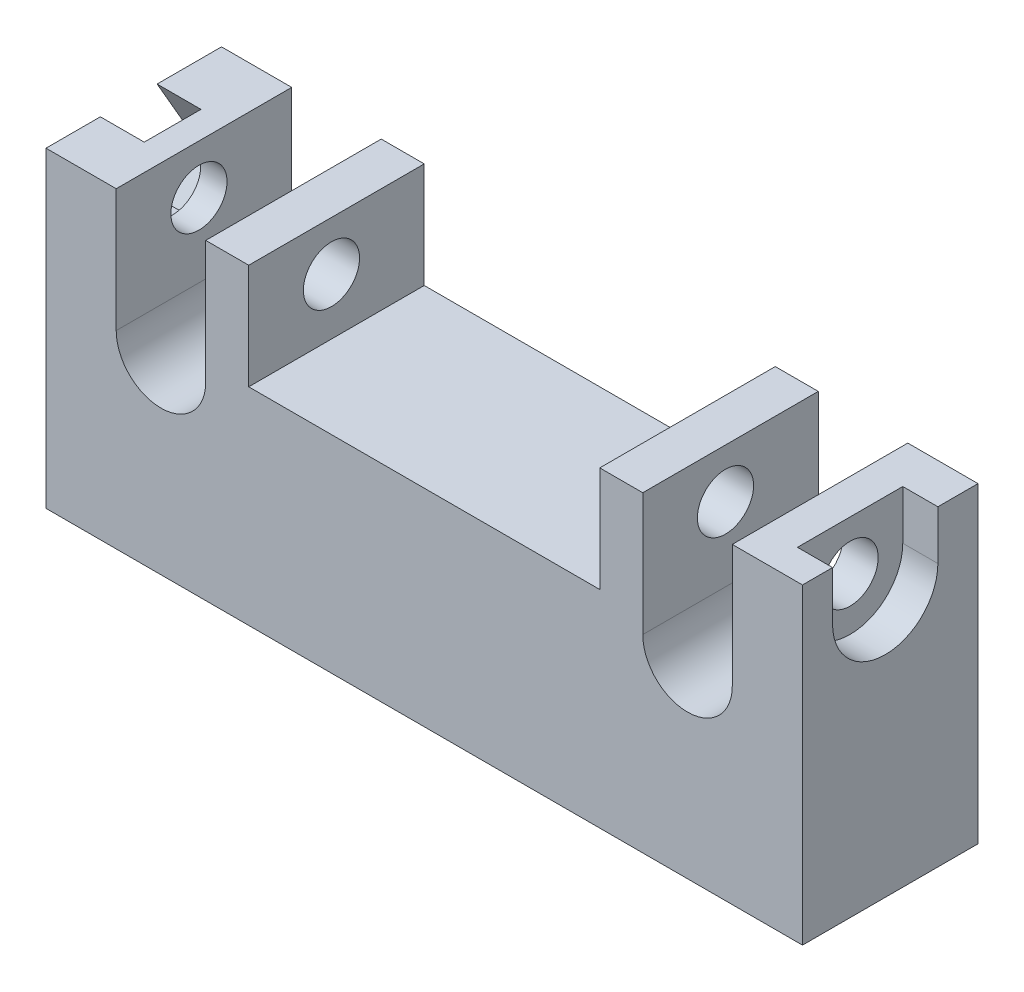
ISO-10303-21;
HEADER;
FILE_DESCRIPTION(('STEP AP214'),'2;1');
FILE_NAME('part.step','',(''),(''),'','','');
FILE_SCHEMA(('AUTOMOTIVE_DESIGN { 1 0 10303 214 1 1 1 1 }'));
ENDSEC;
DATA;
#1=APPLICATION_CONTEXT('core data for automotive mechanical design processes');
#2=APPLICATION_PROTOCOL_DEFINITION('international standard','automotive_design',2000,#1);
#3=PRODUCT_CONTEXT('',#1,'mechanical');
#4=PRODUCT('Part','Part','',(#3));
#5=PRODUCT_RELATED_PRODUCT_CATEGORY('part','',(#4));
#6=PRODUCT_DEFINITION_FORMATION('','',#4);
#7=PRODUCT_DEFINITION_CONTEXT('part definition',#1,'design');
#8=PRODUCT_DEFINITION('design','',#6,#7);
#9=PRODUCT_DEFINITION_SHAPE('','',#8);
#10=(LENGTH_UNIT() NAMED_UNIT(*) SI_UNIT(.MILLI.,.METRE.));
#11=(NAMED_UNIT(*) PLANE_ANGLE_UNIT() SI_UNIT($,.RADIAN.));
#12=(NAMED_UNIT(*) SI_UNIT($,.STERADIAN.) SOLID_ANGLE_UNIT());
#13=UNCERTAINTY_MEASURE_WITH_UNIT(LENGTH_MEASURE(1.E-05),#10,'distance_accuracy_value','');
#14=(GEOMETRIC_REPRESENTATION_CONTEXT(3) GLOBAL_UNCERTAINTY_ASSIGNED_CONTEXT((#13)) GLOBAL_UNIT_ASSIGNED_CONTEXT((#10,
#11,#12)) REPRESENTATION_CONTEXT('',''));
#15=CARTESIAN_POINT('',(0.,0.,0.));
#16=DIRECTION('',(0.,0.,1.));
#17=DIRECTION('',(1.,0.,0.));
#18=AXIS2_PLACEMENT_3D('',#15,#16,#17);
#19=CARTESIAN_POINT('',(-12.45,7.2,10.));
#20=DIRECTION('',(0.,-1.,0.));
#21=DIRECTION('',(0.,0.,-1.));
#22=AXIS2_PLACEMENT_3D('',#19,#20,#21);
#23=PLANE('',#22);
#24=DIRECTION('',(-1.,0.,0.));
#25=VECTOR('',#24,1.);
#26=CARTESIAN_POINT('',(-12.45,7.2,10.));
#27=LINE('',#26,#25);
#28=CARTESIAN_POINT('',(-10.,7.2,10.));
#29=VERTEX_POINT('',#28);
#30=CARTESIAN_POINT('',(-12.45,7.2,10.));
#31=VERTEX_POINT('',#30);
#32=EDGE_CURVE('E404',#29,#31,#27,.T.);
#33=ORIENTED_EDGE('',*,*,#32,.F.);
#34=DIRECTION('',(0.,0.,1.));
#35=VECTOR('',#34,1.);
#36=CARTESIAN_POINT('',(-10.,7.2,0.));
#37=LINE('',#36,#35);
#38=CARTESIAN_POINT('',(-10.,7.2,0.));
#39=VERTEX_POINT('',#38);
#40=EDGE_CURVE('E258',#39,#29,#37,.T.);
#41=ORIENTED_EDGE('',*,*,#40,.F.);
#42=DIRECTION('',(-1.,0.,0.));
#43=VECTOR('',#42,1.);
#44=CARTESIAN_POINT('',(-12.45,7.2,0.));
#45=LINE('',#44,#43);
#46=CARTESIAN_POINT('',(-12.45,7.2,0.));
#47=VERTEX_POINT('',#46);
#48=EDGE_CURVE('E244',#39,#47,#45,.T.);
#49=ORIENTED_EDGE('',*,*,#48,.T.);
#50=DIRECTION('',(0.,0.,-1.));
#51=VECTOR('',#50,1.);
#52=CARTESIAN_POINT('',(-12.45,7.2,10.));
#53=LINE('',#52,#51);
#54=EDGE_CURVE('E476',#31,#47,#53,.T.);
#55=ORIENTED_EDGE('',*,*,#54,.F.);
#56=EDGE_LOOP('',(#33,#41,#49,#55));
#57=FACE_BOUND('',#56,.T.);
#58=ADVANCED_FACE('F43',(#57),#23,.F.);
#59=CARTESIAN_POINT('',(-21.55,4.4,5.28643622009976));
#60=DIRECTION('',(1.,0.,0.));
#61=DIRECTION('',(0.,0.,-1.));
#62=AXIS2_PLACEMENT_3D('',#59,#60,#61);
#63=CYLINDRICAL_SURFACE('',#62,1.6);
#64=CARTESIAN_POINT('',(-10.,4.4,5.28643622009976));
#65=DIRECTION('',(-1.,0.,0.));
#66=DIRECTION('',(0.,-1.,0.));
#67=AXIS2_PLACEMENT_3D('',#64,#65,#66);
#68=CIRCLE('',#67,1.6);
#69=CARTESIAN_POINT('',(-10.,2.8,5.28643622009976));
#70=VERTEX_POINT('',#69);
#71=EDGE_CURVE('E47',#70,#70,#68,.F.);
#72=ORIENTED_EDGE('',*,*,#71,.T.);
#73=EDGE_LOOP('',(#72));
#74=FACE_BOUND('',#73,.T.);
#75=CARTESIAN_POINT('',(-12.45,4.4,5.28643622009976));
#76=DIRECTION('',(1.,0.,0.));
#77=DIRECTION('',(0.,1.,0.));
#78=AXIS2_PLACEMENT_3D('',#75,#76,#77);
#79=CIRCLE('',#78,1.6);
#80=CARTESIAN_POINT('',(-12.45,6.,5.28643622009976));
#81=VERTEX_POINT('',#80);
#82=EDGE_CURVE('E367',#81,#81,#79,.T.);
#83=ORIENTED_EDGE('',*,*,#82,.F.);
#84=EDGE_LOOP('',(#83));
#85=FACE_BOUND('',#84,.T.);
#86=ADVANCED_FACE('F520',(#74,#85),#63,.F.);
#87=CARTESIAN_POINT('',(-17.55,4.4,5.28643622009976));
#88=DIRECTION('',(-1.,0.,0.));
#89=DIRECTION('',(0.,-1.,0.));
#90=AXIS2_PLACEMENT_3D('',#87,#88,#89);
#91=CIRCLE('',#90,1.6);
#92=CARTESIAN_POINT('',(-17.55,2.8,5.28643622009976));
#93=VERTEX_POINT('',#92);
#94=EDGE_CURVE('E372',#93,#93,#91,.T.);
#95=ORIENTED_EDGE('',*,*,#94,.F.);
#96=EDGE_LOOP('',(#95));
#97=FACE_BOUND('',#96,.T.);
#98=CARTESIAN_POINT('',(-19.05,4.4,5.28643622009976));
#99=DIRECTION('',(-1.,0.,0.));
#100=DIRECTION('',(0.,0.,1.));
#101=AXIS2_PLACEMENT_3D('',#98,#99,#100);
#102=CIRCLE('',#101,1.6);
#103=CARTESIAN_POINT('',(-19.05,4.4,6.88643622009976));
#104=VERTEX_POINT('',#103);
#105=EDGE_CURVE('E311',#104,#104,#102,.F.);
#106=ORIENTED_EDGE('',*,*,#105,.F.);
#107=EDGE_LOOP('',(#106));
#108=FACE_BOUND('',#107,.T.);
#109=ADVANCED_FACE('F543',(#97,#108),#63,.F.);
#110=CARTESIAN_POINT('',(-21.55,-10.5744171518266,10.));
#111=DIRECTION('',(1.,0.,0.));
#112=DIRECTION('',(0.,0.,-1.));
#113=AXIS2_PLACEMENT_3D('',#110,#111,#112);
#114=PLANE('',#113);
#115=DIRECTION('',(0.,-0.866025403784439,0.5));
#116=VECTOR('',#115,1.);
#117=CARTESIAN_POINT('',(-21.55,4.4,2.05327471263786));
#118=LINE('',#117,#116);
#119=CARTESIAN_POINT('',(-21.55,4.4,2.05327471263786));
#120=VERTEX_POINT('',#119);
#121=CARTESIAN_POINT('',(-21.55,1.6,3.66985546636881));
#122=VERTEX_POINT('',#121);
#123=EDGE_CURVE('E301',#120,#122,#118,.T.);
#124=ORIENTED_EDGE('',*,*,#123,.F.);
#125=DIRECTION('',(0.,-0.866025403784439,-0.5));
#126=VECTOR('',#125,1.);
#127=CARTESIAN_POINT('',(-21.55,7.2,3.66985546636881));
#128=LINE('',#127,#126);
#129=CARTESIAN_POINT('',(-21.55,7.2,3.66985546636881));
#130=VERTEX_POINT('',#129);
#131=EDGE_CURVE('E297',#130,#120,#128,.T.);
#132=ORIENTED_EDGE('',*,*,#131,.F.);
#133=DIRECTION('',(0.,0.,-1.));
#134=VECTOR('',#133,1.);
#135=CARTESIAN_POINT('',(-21.55,7.2,10.));
#136=LINE('',#135,#134);
#137=CARTESIAN_POINT('',(-21.55,7.2,0.));
#138=VERTEX_POINT('',#137);
#139=EDGE_CURVE('E421',#130,#138,#136,.T.);
#140=ORIENTED_EDGE('',*,*,#139,.T.);
#141=DIRECTION('',(0.,-1.,0.));
#142=VECTOR('',#141,1.);
#143=CARTESIAN_POINT('',(-21.55,-10.5744171518266,0.));
#144=LINE('',#143,#142);
#145=CARTESIAN_POINT('',(-21.55,-10.5744171518266,0.));
#146=VERTEX_POINT('',#145);
#147=EDGE_CURVE('E380',#138,#146,#144,.T.);
#148=ORIENTED_EDGE('',*,*,#147,.T.);
#149=DIRECTION('',(0.,0.,-1.));
#150=VECTOR('',#149,1.);
#151=CARTESIAN_POINT('',(-21.55,-10.5744171518266,10.));
#152=LINE('',#151,#150);
#153=CARTESIAN_POINT('',(-21.55,-10.5744171518266,10.));
#154=VERTEX_POINT('',#153);
#155=EDGE_CURVE('E11',#154,#146,#152,.T.);
#156=ORIENTED_EDGE('',*,*,#155,.F.);
#157=DIRECTION('',(0.,-1.,0.));
#158=VECTOR('',#157,1.);
#159=CARTESIAN_POINT('',(-21.55,-10.5744171518266,10.));
#160=LINE('',#159,#158);
#161=CARTESIAN_POINT('',(-21.55,7.2,10.));
#162=VERTEX_POINT('',#161);
#163=EDGE_CURVE('E381',#162,#154,#160,.T.);
#164=ORIENTED_EDGE('',*,*,#163,.F.);
#165=CARTESIAN_POINT('',(-21.55,7.2,6.90301697383071));
#166=VERTEX_POINT('',#165);
#167=EDGE_CURVE('E460',#162,#166,#136,.T.);
#168=ORIENTED_EDGE('',*,*,#167,.T.);
#169=DIRECTION('',(0.,0.866025403784439,-0.5));
#170=VECTOR('',#169,1.);
#171=CARTESIAN_POINT('',(-21.55,4.4,8.51959772756167));
#172=LINE('',#171,#170);
#173=CARTESIAN_POINT('',(-21.55,4.4,8.51959772756167));
#174=VERTEX_POINT('',#173);
#175=EDGE_CURVE('E294',#174,#166,#172,.T.);
#176=ORIENTED_EDGE('',*,*,#175,.F.);
#177=DIRECTION('',(0.,0.866025403784438,0.5));
#178=VECTOR('',#177,1.);
#179=CARTESIAN_POINT('',(-21.55,1.6,6.90301697383071));
#180=LINE('',#179,#178);
#181=CARTESIAN_POINT('',(-21.55,1.6,6.90301697383071));
#182=VERTEX_POINT('',#181);
#183=EDGE_CURVE('E290',#182,#174,#180,.T.);
#184=ORIENTED_EDGE('',*,*,#183,.F.);
#185=DIRECTION('',(0.,0.,1.));
#186=VECTOR('',#185,1.);
#187=CARTESIAN_POINT('',(-21.55,1.6,3.66985546636881));
#188=LINE('',#187,#186);
#189=EDGE_CURVE('E271',#122,#182,#188,.T.);
#190=ORIENTED_EDGE('',*,*,#189,.F.);
#191=EDGE_LOOP('',(#124,#132,#140,#148,#156,#164,#168,#176,#184,#190));
#192=FACE_BOUND('',#191,.T.);
#193=ADVANCED_FACE('F45',(#192),#114,.F.);
#194=CARTESIAN_POINT('',(21.55,-10.5744171518266,10.));
#195=DIRECTION('',(0.,1.,0.));
#196=DIRECTION('',(-1.,0.,0.));
#197=AXIS2_PLACEMENT_3D('',#194,#195,#196);
#198=PLANE('',#197);
#199=DIRECTION('',(1.,0.,0.));
#200=VECTOR('',#199,1.);
#201=CARTESIAN_POINT('',(21.55,-10.5744171518266,0.));
#202=LINE('',#201,#200);
#203=CARTESIAN_POINT('',(21.55,-10.5744171518266,0.));
#204=VERTEX_POINT('',#203);
#205=EDGE_CURVE('E425',#146,#204,#202,.T.);
#206=ORIENTED_EDGE('',*,*,#205,.T.);
#207=DIRECTION('',(0.,0.,-1.));
#208=VECTOR('',#207,1.);
#209=CARTESIAN_POINT('',(21.55,-10.5744171518266,10.));
#210=LINE('',#209,#208);
#211=CARTESIAN_POINT('',(21.55,-10.5744171518266,10.));
#212=VERTEX_POINT('',#211);
#213=EDGE_CURVE('E53',#212,#204,#210,.T.);
#214=ORIENTED_EDGE('',*,*,#213,.F.);
#215=DIRECTION('',(1.,0.,0.));
#216=VECTOR('',#215,1.);
#217=CARTESIAN_POINT('',(21.55,-10.5744171518266,10.));
#218=LINE('',#217,#216);
#219=EDGE_CURVE('E385',#154,#212,#218,.T.);
#220=ORIENTED_EDGE('',*,*,#219,.F.);
#221=ORIENTED_EDGE('',*,*,#155,.T.);
#222=EDGE_LOOP('',(#206,#214,#220,#221));
#223=FACE_BOUND('',#222,.T.);
#224=ADVANCED_FACE('F594',(#223),#198,.F.);
#225=CARTESIAN_POINT('',(21.55,7.2,10.));
#226=DIRECTION('',(-1.,0.,0.));
#227=DIRECTION('',(0.,-1.,0.));
#228=AXIS2_PLACEMENT_3D('',#225,#226,#227);
#229=PLANE('',#228);
#230=CARTESIAN_POINT('',(21.55,4.4,5.28643622009976));
#231=DIRECTION('',(1.,0.,0.));
#232=DIRECTION('',(0.,0.,1.));
#233=AXIS2_PLACEMENT_3D('',#230,#231,#232);
#234=CIRCLE('',#233,3.);
#235=CARTESIAN_POINT('',(21.55,4.4,8.28643622009976));
#236=VERTEX_POINT('',#235);
#237=CARTESIAN_POINT('',(21.55,4.4,2.28643622009976));
#238=VERTEX_POINT('',#237);
#239=EDGE_CURVE('E348',#236,#238,#234,.T.);
#240=ORIENTED_EDGE('',*,*,#239,.F.);
#241=DIRECTION('',(0.,-1.,0.));
#242=VECTOR('',#241,1.);
#243=CARTESIAN_POINT('',(21.55,4.4,8.28643622009976));
#244=LINE('',#243,#242);
#245=CARTESIAN_POINT('',(21.55,7.2,8.28643622009976));
#246=VERTEX_POINT('',#245);
#247=EDGE_CURVE('E344',#246,#236,#244,.T.);
#248=ORIENTED_EDGE('',*,*,#247,.F.);
#249=DIRECTION('',(0.,0.,-1.));
#250=VECTOR('',#249,1.);
#251=CARTESIAN_POINT('',(21.55,7.2,10.));
#252=LINE('',#251,#250);
#253=CARTESIAN_POINT('',(21.55,7.2,10.));
#254=VERTEX_POINT('',#253);
#255=EDGE_CURVE('E497',#254,#246,#252,.T.);
#256=ORIENTED_EDGE('',*,*,#255,.F.);
#257=DIRECTION('',(0.,1.,0.));
#258=VECTOR('',#257,1.);
#259=CARTESIAN_POINT('',(21.55,7.2,10.));
#260=LINE('',#259,#258);
#261=EDGE_CURVE('E389',#212,#254,#260,.T.);
#262=ORIENTED_EDGE('',*,*,#261,.F.);
#263=ORIENTED_EDGE('',*,*,#213,.T.);
#264=DIRECTION('',(0.,1.,0.));
#265=VECTOR('',#264,1.);
#266=CARTESIAN_POINT('',(21.55,7.2,0.));
#267=LINE('',#266,#265);
#268=CARTESIAN_POINT('',(21.55,7.2,0.));
#269=VERTEX_POINT('',#268);
#270=EDGE_CURVE('E428',#204,#269,#267,.T.);
#271=ORIENTED_EDGE('',*,*,#270,.T.);
#272=CARTESIAN_POINT('',(21.55,7.2,2.28643622009976));
#273=VERTEX_POINT('',#272);
#274=EDGE_CURVE('E496',#273,#269,#252,.T.);
#275=ORIENTED_EDGE('',*,*,#274,.F.);
#276=DIRECTION('',(0.,1.,0.));
#277=VECTOR('',#276,1.);
#278=CARTESIAN_POINT('',(21.55,7.2,2.28643622009976));
#279=LINE('',#278,#277);
#280=EDGE_CURVE('E332',#238,#273,#279,.T.);
#281=ORIENTED_EDGE('',*,*,#280,.F.);
#282=EDGE_LOOP('',(#240,#248,#256,#262,#263,#271,#275,#281));
#283=FACE_BOUND('',#282,.T.);
#284=ADVANCED_FACE('F589',(#283),#229,.F.);
#285=CARTESIAN_POINT('',(17.55,7.2,10.));
#286=DIRECTION('',(0.,-1.,0.));
#287=DIRECTION('',(0.,0.,-1.));
#288=AXIS2_PLACEMENT_3D('',#285,#286,#287);
#289=PLANE('',#288);
#290=ORIENTED_EDGE('',*,*,#255,.T.);
#291=DIRECTION('',(1.,0.,0.));
#292=VECTOR('',#291,1.);
#293=CARTESIAN_POINT('',(19.55,7.2,8.28643622009976));
#294=LINE('',#293,#292);
#295=CARTESIAN_POINT('',(19.55,7.2,8.28643622009976));
#296=VERTEX_POINT('',#295);
#297=EDGE_CURVE('E354',#296,#246,#294,.T.);
#298=ORIENTED_EDGE('',*,*,#297,.F.);
#299=DIRECTION('',(0.,0.,1.));
#300=VECTOR('',#299,1.);
#301=CARTESIAN_POINT('',(19.55,7.2,8.28643622009976));
#302=LINE('',#301,#300);
#303=CARTESIAN_POINT('',(19.55,7.2,2.28643622009976));
#304=VERTEX_POINT('',#303);
#305=EDGE_CURVE('E339',#304,#296,#302,.T.);
#306=ORIENTED_EDGE('',*,*,#305,.F.);
#307=DIRECTION('',(1.,0.,0.));
#308=VECTOR('',#307,1.);
#309=CARTESIAN_POINT('',(19.55,7.2,2.28643622009976));
#310=LINE('',#309,#308);
#311=EDGE_CURVE('E358',#304,#273,#310,.T.);
#312=ORIENTED_EDGE('',*,*,#311,.T.);
#313=ORIENTED_EDGE('',*,*,#274,.T.);
#314=DIRECTION('',(-1.,0.,0.));
#315=VECTOR('',#314,1.);
#316=CARTESIAN_POINT('',(17.55,7.2,0.));
#317=LINE('',#316,#315);
#318=CARTESIAN_POINT('',(17.55,7.2,0.));
#319=VERTEX_POINT('',#318);
#320=EDGE_CURVE('E432',#269,#319,#317,.T.);
#321=ORIENTED_EDGE('',*,*,#320,.T.);
#322=DIRECTION('',(0.,0.,-1.));
#323=VECTOR('',#322,1.);
#324=CARTESIAN_POINT('',(17.55,7.2,10.));
#325=LINE('',#324,#323);
#326=CARTESIAN_POINT('',(17.55,7.2,10.));
#327=VERTEX_POINT('',#326);
#328=EDGE_CURVE('E492',#327,#319,#325,.T.);
#329=ORIENTED_EDGE('',*,*,#328,.F.);
#330=DIRECTION('',(-1.,0.,0.));
#331=VECTOR('',#330,1.);
#332=CARTESIAN_POINT('',(17.55,7.2,10.));
#333=LINE('',#332,#331);
#334=EDGE_CURVE('E392',#254,#327,#333,.T.);
#335=ORIENTED_EDGE('',*,*,#334,.F.);
#336=EDGE_LOOP('',(#290,#298,#306,#312,#313,#321,#329,#335));
#337=FACE_BOUND('',#336,.T.);
#338=ADVANCED_FACE('F580',(#337),#289,.F.);
#339=CARTESIAN_POINT('',(17.55,0.200000000000001,10.));
#340=DIRECTION('',(1.,0.,0.));
#341=DIRECTION('',(0.,0.,-1.));
#342=AXIS2_PLACEMENT_3D('',#339,#340,#341);
#343=PLANE('',#342);
#344=CARTESIAN_POINT('',(17.55,4.4,5.28643622009976));
#345=DIRECTION('',(1.,0.,0.));
#346=DIRECTION('',(0.,0.,-1.));
#347=AXIS2_PLACEMENT_3D('',#344,#345,#346);
#348=CIRCLE('',#347,1.6);
#349=CARTESIAN_POINT('',(17.55,4.4,3.68643622009976));
#350=VERTEX_POINT('',#349);
#351=EDGE_CURVE('E376',#350,#350,#348,.T.);
#352=ORIENTED_EDGE('',*,*,#351,.T.);
#353=EDGE_LOOP('',(#352));
#354=FACE_BOUND('',#353,.T.);
#355=DIRECTION('',(0.,-1.,0.));
#356=VECTOR('',#355,1.);
#357=CARTESIAN_POINT('',(17.55,0.200000000000001,0.));
#358=LINE('',#357,#356);
#359=CARTESIAN_POINT('',(17.55,0.200000000000001,0.));
#360=VERTEX_POINT('',#359);
#361=EDGE_CURVE('E435',#319,#360,#358,.T.);
#362=ORIENTED_EDGE('',*,*,#361,.T.);
#363=DIRECTION('',(0.,0.,-1.));
#364=VECTOR('',#363,1.);
#365=CARTESIAN_POINT('',(17.55,0.200000000000001,10.));
#366=LINE('',#365,#364);
#367=CARTESIAN_POINT('',(17.55,0.200000000000001,10.));
#368=VERTEX_POINT('',#367);
#369=EDGE_CURVE('E488',#368,#360,#366,.T.);
#370=ORIENTED_EDGE('',*,*,#369,.F.);
#371=DIRECTION('',(0.,-1.,0.));
#372=VECTOR('',#371,1.);
#373=CARTESIAN_POINT('',(17.55,0.200000000000001,10.));
#374=LINE('',#373,#372);
#375=EDGE_CURVE('E395',#327,#368,#374,.T.);
#376=ORIENTED_EDGE('',*,*,#375,.F.);
#377=ORIENTED_EDGE('',*,*,#328,.T.);
#378=EDGE_LOOP('',(#362,#370,#376,#377));
#379=FACE_BOUND('',#378,.T.);
#380=ADVANCED_FACE('F575',(#354,#379),#343,.F.);
#381=CARTESIAN_POINT('',(15.,0.200000000000001,10.));
#382=DIRECTION('',(0.,0.,-1.));
#383=DIRECTION('',(-1.,0.,0.));
#384=AXIS2_PLACEMENT_3D('',#381,#382,#383);
#385=CYLINDRICAL_SURFACE('',#384,2.55);
#386=CARTESIAN_POINT('',(15.,0.200000000000001,0.));
#387=DIRECTION('',(0.,0.,-1.));
#388=DIRECTION('',(1.,0.,0.));
#389=AXIS2_PLACEMENT_3D('',#386,#387,#388);
#390=CIRCLE('',#389,2.55);
#391=CARTESIAN_POINT('',(12.45,0.200000000000001,0.));
#392=VERTEX_POINT('',#391);
#393=EDGE_CURVE('E438',#360,#392,#390,.T.);
#394=ORIENTED_EDGE('',*,*,#393,.T.);
#395=DIRECTION('',(0.,0.,-1.));
#396=VECTOR('',#395,1.);
#397=CARTESIAN_POINT('',(12.45,0.200000000000001,10.));
#398=LINE('',#397,#396);
#399=CARTESIAN_POINT('',(12.45,0.200000000000001,10.));
#400=VERTEX_POINT('',#399);
#401=EDGE_CURVE('E484',#400,#392,#398,.T.);
#402=ORIENTED_EDGE('',*,*,#401,.F.);
#403=CARTESIAN_POINT('',(15.,0.200000000000001,10.));
#404=DIRECTION('',(0.,0.,-1.));
#405=DIRECTION('',(1.,0.,0.));
#406=AXIS2_PLACEMENT_3D('',#403,#404,#405);
#407=CIRCLE('',#406,2.55);
#408=EDGE_CURVE('E398',#368,#400,#407,.T.);
#409=ORIENTED_EDGE('',*,*,#408,.F.);
#410=ORIENTED_EDGE('',*,*,#369,.T.);
#411=EDGE_LOOP('',(#394,#402,#409,#410));
#412=FACE_BOUND('',#411,.T.);
#413=ADVANCED_FACE('F559',(#412),#385,.F.);
#414=CARTESIAN_POINT('',(12.45,7.2,10.));
#415=DIRECTION('',(-1.,0.,0.));
#416=DIRECTION('',(0.,-1.,0.));
#417=AXIS2_PLACEMENT_3D('',#414,#415,#416);
#418=PLANE('',#417);
#419=CARTESIAN_POINT('',(12.45,4.4,5.28643622009976));
#420=DIRECTION('',(-1.,0.,0.));
#421=DIRECTION('',(0.,-1.,0.));
#422=AXIS2_PLACEMENT_3D('',#419,#420,#421);
#423=CIRCLE('',#422,1.6);
#424=CARTESIAN_POINT('',(12.45,2.8,5.28643622009976));
#425=VERTEX_POINT('',#424);
#426=EDGE_CURVE('E371',#425,#425,#423,.T.);
#427=ORIENTED_EDGE('',*,*,#426,.T.);
#428=EDGE_LOOP('',(#427));
#429=FACE_BOUND('',#428,.T.);
#430=DIRECTION('',(0.,1.,0.));
#431=VECTOR('',#430,1.);
#432=CARTESIAN_POINT('',(12.45,7.2,0.));
#433=LINE('',#432,#431);
#434=CARTESIAN_POINT('',(12.45,7.2,0.));
#435=VERTEX_POINT('',#434);
#436=EDGE_CURVE('E441',#392,#435,#433,.T.);
#437=ORIENTED_EDGE('',*,*,#436,.T.);
#438=DIRECTION('',(0.,0.,-1.));
#439=VECTOR('',#438,1.);
#440=CARTESIAN_POINT('',(12.45,7.2,10.));
#441=LINE('',#440,#439);
#442=CARTESIAN_POINT('',(12.45,7.2,10.));
#443=VERTEX_POINT('',#442);
#444=EDGE_CURVE('E480',#443,#435,#441,.T.);
#445=ORIENTED_EDGE('',*,*,#444,.F.);
#446=DIRECTION('',(0.,1.,0.));
#447=VECTOR('',#446,1.);
#448=CARTESIAN_POINT('',(12.45,7.2,10.));
#449=LINE('',#448,#447);
#450=EDGE_CURVE('E401',#400,#443,#449,.T.);
#451=ORIENTED_EDGE('',*,*,#450,.F.);
#452=ORIENTED_EDGE('',*,*,#401,.T.);
#453=EDGE_LOOP('',(#437,#445,#451,#452));
#454=FACE_BOUND('',#453,.T.);
#455=ADVANCED_FACE('F551',(#429,#454),#418,.F.);
#456=CARTESIAN_POINT('',(10.,7.2,0.));
#457=VERTEX_POINT('',#456);
#458=EDGE_CURVE('E444',#435,#457,#45,.T.);
#459=ORIENTED_EDGE('',*,*,#458,.T.);
#460=DIRECTION('',(0.,0.,1.));
#461=VECTOR('',#460,1.);
#462=CARTESIAN_POINT('',(10.,7.2,0.));
#463=LINE('',#462,#461);
#464=CARTESIAN_POINT('',(10.,7.2,10.));
#465=VERTEX_POINT('',#464);
#466=EDGE_CURVE('E262',#457,#465,#463,.T.);
#467=ORIENTED_EDGE('',*,*,#466,.T.);
#468=EDGE_CURVE('E405',#443,#465,#27,.T.);
#469=ORIENTED_EDGE('',*,*,#468,.F.);
#470=ORIENTED_EDGE('',*,*,#444,.T.);
#471=EDGE_LOOP('',(#459,#467,#469,#470));
#472=FACE_BOUND('',#471,.T.);
#473=ADVANCED_FACE('F539',(#472),#23,.F.);
#474=CARTESIAN_POINT('',(-12.45,0.200000000000002,10.));
#475=DIRECTION('',(1.,0.,0.));
#476=DIRECTION('',(0.,1.,0.));
#477=AXIS2_PLACEMENT_3D('',#474,#475,#476);
#478=PLANE('',#477);
#479=ORIENTED_EDGE('',*,*,#82,.T.);
#480=EDGE_LOOP('',(#479));
#481=FACE_BOUND('',#480,.T.);
#482=DIRECTION('',(0.,-1.,0.));
#483=VECTOR('',#482,1.);
#484=CARTESIAN_POINT('',(-12.45,0.200000000000002,0.));
#485=LINE('',#484,#483);
#486=CARTESIAN_POINT('',(-12.45,0.200000000000001,0.));
#487=VERTEX_POINT('',#486);
#488=EDGE_CURVE('E448',#47,#487,#485,.T.);
#489=ORIENTED_EDGE('',*,*,#488,.T.);
#490=DIRECTION('',(0.,0.,-1.));
#491=VECTOR('',#490,1.);
#492=CARTESIAN_POINT('',(-12.45,0.200000000000001,10.));
#493=LINE('',#492,#491);
#494=CARTESIAN_POINT('',(-12.45,0.200000000000001,10.));
#495=VERTEX_POINT('',#494);
#496=EDGE_CURVE('E472',#495,#487,#493,.T.);
#497=ORIENTED_EDGE('',*,*,#496,.F.);
#498=DIRECTION('',(0.,-1.,0.));
#499=VECTOR('',#498,1.);
#500=CARTESIAN_POINT('',(-12.45,0.200000000000002,10.));
#501=LINE('',#500,#499);
#502=EDGE_CURVE('E409',#31,#495,#501,.T.);
#503=ORIENTED_EDGE('',*,*,#502,.F.);
#504=ORIENTED_EDGE('',*,*,#54,.T.);
#505=EDGE_LOOP('',(#489,#497,#503,#504));
#506=FACE_BOUND('',#505,.T.);
#507=ADVANCED_FACE('F550',(#481,#506),#478,.F.);
#508=CARTESIAN_POINT('',(-15.,0.200000000000001,10.));
#509=DIRECTION('',(0.,0.,-1.));
#510=DIRECTION('',(-1.,0.,0.));
#511=AXIS2_PLACEMENT_3D('',#508,#509,#510);
#512=CYLINDRICAL_SURFACE('',#511,2.55);
#513=CARTESIAN_POINT('',(-15.,0.200000000000001,0.));
#514=DIRECTION('',(0.,0.,-1.));
#515=DIRECTION('',(1.,0.,0.));
#516=AXIS2_PLACEMENT_3D('',#513,#514,#515);
#517=CIRCLE('',#516,2.55);
#518=CARTESIAN_POINT('',(-17.55,0.200000000000001,0.));
#519=VERTEX_POINT('',#518);
#520=EDGE_CURVE('E451',#487,#519,#517,.T.);
#521=ORIENTED_EDGE('',*,*,#520,.T.);
#522=DIRECTION('',(0.,0.,-1.));
#523=VECTOR('',#522,1.);
#524=CARTESIAN_POINT('',(-17.55,0.200000000000001,10.));
#525=LINE('',#524,#523);
#526=CARTESIAN_POINT('',(-17.55,0.200000000000001,10.));
#527=VERTEX_POINT('',#526);
#528=EDGE_CURVE('E468',#527,#519,#525,.T.);
#529=ORIENTED_EDGE('',*,*,#528,.F.);
#530=CARTESIAN_POINT('',(-15.,0.200000000000001,10.));
#531=DIRECTION('',(0.,0.,-1.));
#532=DIRECTION('',(1.,0.,0.));
#533=AXIS2_PLACEMENT_3D('',#530,#531,#532);
#534=CIRCLE('',#533,2.55);
#535=EDGE_CURVE('E412',#495,#527,#534,.T.);
#536=ORIENTED_EDGE('',*,*,#535,.F.);
#537=ORIENTED_EDGE('',*,*,#496,.T.);
#538=EDGE_LOOP('',(#521,#529,#536,#537));
#539=FACE_BOUND('',#538,.T.);
#540=ADVANCED_FACE('F557',(#539),#512,.F.);
#541=CARTESIAN_POINT('',(-17.55,7.2,10.));
#542=DIRECTION('',(-1.,0.,0.));
#543=DIRECTION('',(0.,-1.,0.));
#544=AXIS2_PLACEMENT_3D('',#541,#542,#543);
#545=PLANE('',#544);
#546=ORIENTED_EDGE('',*,*,#94,.T.);
#547=EDGE_LOOP('',(#546));
#548=FACE_BOUND('',#547,.T.);
#549=DIRECTION('',(0.,1.,0.));
#550=VECTOR('',#549,1.);
#551=CARTESIAN_POINT('',(-17.55,7.2,0.));
#552=LINE('',#551,#550);
#553=CARTESIAN_POINT('',(-17.55,7.2,0.));
#554=VERTEX_POINT('',#553);
#555=EDGE_CURVE('E454',#519,#554,#552,.T.);
#556=ORIENTED_EDGE('',*,*,#555,.T.);
#557=DIRECTION('',(0.,0.,-1.));
#558=VECTOR('',#557,1.);
#559=CARTESIAN_POINT('',(-17.55,7.2,10.));
#560=LINE('',#559,#558);
#561=CARTESIAN_POINT('',(-17.55,7.2,10.));
#562=VERTEX_POINT('',#561);
#563=EDGE_CURVE('E464',#562,#554,#560,.T.);
#564=ORIENTED_EDGE('',*,*,#563,.F.);
#565=DIRECTION('',(0.,1.,0.));
#566=VECTOR('',#565,1.);
#567=CARTESIAN_POINT('',(-17.55,7.2,10.));
#568=LINE('',#567,#566);
#569=EDGE_CURVE('E415',#527,#562,#568,.T.);
#570=ORIENTED_EDGE('',*,*,#569,.F.);
#571=ORIENTED_EDGE('',*,*,#528,.T.);
#572=EDGE_LOOP('',(#556,#564,#570,#571));
#573=FACE_BOUND('',#572,.T.);
#574=ADVANCED_FACE('F613',(#548,#573),#545,.F.);
#575=CARTESIAN_POINT('',(-21.55,7.2,10.));
#576=DIRECTION('',(0.,-1.,0.));
#577=DIRECTION('',(0.,0.,-1.));
#578=AXIS2_PLACEMENT_3D('',#575,#576,#577);
#579=PLANE('',#578);
#580=ORIENTED_EDGE('',*,*,#139,.F.);
#581=DIRECTION('',(-1.,0.,0.));
#582=VECTOR('',#581,1.);
#583=CARTESIAN_POINT('',(-19.05,7.2,3.66985546636881));
#584=LINE('',#583,#582);
#585=CARTESIAN_POINT('',(-19.05,7.2,3.66985546636881));
#586=VERTEX_POINT('',#585);
#587=EDGE_CURVE('E318',#586,#130,#584,.T.);
#588=ORIENTED_EDGE('',*,*,#587,.F.);
#589=DIRECTION('',(0.,0.,-1.));
#590=VECTOR('',#589,1.);
#591=CARTESIAN_POINT('',(-19.05,7.2,6.90301697383071));
#592=LINE('',#591,#590);
#593=CARTESIAN_POINT('',(-19.05,7.2,6.90301697383071));
#594=VERTEX_POINT('',#593);
#595=EDGE_CURVE('E274',#594,#586,#592,.T.);
#596=ORIENTED_EDGE('',*,*,#595,.F.);
#597=DIRECTION('',(-1.,0.,0.));
#598=VECTOR('',#597,1.);
#599=CARTESIAN_POINT('',(-19.05,7.2,6.90301697383071));
#600=LINE('',#599,#598);
#601=EDGE_CURVE('E321',#594,#166,#600,.T.);
#602=ORIENTED_EDGE('',*,*,#601,.T.);
#603=ORIENTED_EDGE('',*,*,#167,.F.);
#604=DIRECTION('',(-1.,0.,0.));
#605=VECTOR('',#604,1.);
#606=CARTESIAN_POINT('',(-21.55,7.2,10.));
#607=LINE('',#606,#605);
#608=EDGE_CURVE('E418',#562,#162,#607,.T.);
#609=ORIENTED_EDGE('',*,*,#608,.F.);
#610=ORIENTED_EDGE('',*,*,#563,.T.);
#611=DIRECTION('',(-1.,0.,0.));
#612=VECTOR('',#611,1.);
#613=CARTESIAN_POINT('',(-21.55,7.2,0.));
#614=LINE('',#613,#612);
#615=EDGE_CURVE('E386',#554,#138,#614,.T.);
#616=ORIENTED_EDGE('',*,*,#615,.T.);
#617=EDGE_LOOP('',(#580,#588,#596,#602,#603,#609,#610,#616));
#618=FACE_BOUND('',#617,.T.);
#619=ADVANCED_FACE('F607',(#618),#579,.F.);
#620=CARTESIAN_POINT('',(-15.,0.200000000000001,10.));
#621=DIRECTION('',(0.,0.,1.));
#622=DIRECTION('',(1.,0.,0.));
#623=AXIS2_PLACEMENT_3D('',#620,#621,#622);
#624=PLANE('',#623);
#625=DIRECTION('',(0.,-1.,0.));
#626=VECTOR('',#625,1.);
#627=CARTESIAN_POINT('',(-10.,7.2,10.));
#628=LINE('',#627,#626);
#629=CARTESIAN_POINT('',(-10.,1.2,10.));
#630=VERTEX_POINT('',#629);
#631=EDGE_CURVE('E228',#29,#630,#628,.T.);
#632=ORIENTED_EDGE('',*,*,#631,.F.);
#633=ORIENTED_EDGE('',*,*,#32,.T.);
#634=ORIENTED_EDGE('',*,*,#502,.T.);
#635=ORIENTED_EDGE('',*,*,#535,.T.);
#636=ORIENTED_EDGE('',*,*,#569,.T.);
#637=ORIENTED_EDGE('',*,*,#608,.T.);
#638=ORIENTED_EDGE('',*,*,#163,.T.);
#639=ORIENTED_EDGE('',*,*,#219,.T.);
#640=ORIENTED_EDGE('',*,*,#261,.T.);
#641=ORIENTED_EDGE('',*,*,#334,.T.);
#642=ORIENTED_EDGE('',*,*,#375,.T.);
#643=ORIENTED_EDGE('',*,*,#408,.T.);
#644=ORIENTED_EDGE('',*,*,#450,.T.);
#645=ORIENTED_EDGE('',*,*,#468,.T.);
#646=DIRECTION('',(0.,1.,0.));
#647=VECTOR('',#646,1.);
#648=CARTESIAN_POINT('',(10.,7.2,10.));
#649=LINE('',#648,#647);
#650=CARTESIAN_POINT('',(10.,1.2,10.));
#651=VERTEX_POINT('',#650);
#652=EDGE_CURVE('E246',#651,#465,#649,.T.);
#653=ORIENTED_EDGE('',*,*,#652,.F.);
#654=DIRECTION('',(1.,0.,0.));
#655=VECTOR('',#654,1.);
#656=CARTESIAN_POINT('',(-10.,1.2,10.));
#657=LINE('',#656,#655);
#658=EDGE_CURVE('E249',#630,#651,#657,.T.);
#659=ORIENTED_EDGE('',*,*,#658,.F.);
#660=EDGE_LOOP('',(#632,#633,#634,#635,#636,#637,#638,#639,#640,#641,#642,#643,#644,#645,#653,#659));
#661=FACE_BOUND('',#660,.T.);
#662=ADVANCED_FACE('F625',(#661),#624,.T.);
#663=CARTESIAN_POINT('',(-15.,0.200000000000001,0.));
#664=DIRECTION('',(0.,0.,1.));
#665=DIRECTION('',(1.,0.,0.));
#666=AXIS2_PLACEMENT_3D('',#663,#664,#665);
#667=PLANE('',#666);
#668=ORIENTED_EDGE('',*,*,#48,.F.);
#669=DIRECTION('',(0.,-1.,0.));
#670=VECTOR('',#669,1.);
#671=CARTESIAN_POINT('',(-10.,7.2,0.));
#672=LINE('',#671,#670);
#673=CARTESIAN_POINT('',(-10.,1.2,0.));
#674=VERTEX_POINT('',#673);
#675=EDGE_CURVE('E225',#39,#674,#672,.T.);
#676=ORIENTED_EDGE('',*,*,#675,.T.);
#677=DIRECTION('',(1.,0.,0.));
#678=VECTOR('',#677,1.);
#679=CARTESIAN_POINT('',(-10.,1.2,0.));
#680=LINE('',#679,#678);
#681=CARTESIAN_POINT('',(10.,1.2,0.));
#682=VERTEX_POINT('',#681);
#683=EDGE_CURVE('E236',#674,#682,#680,.T.);
#684=ORIENTED_EDGE('',*,*,#683,.T.);
#685=DIRECTION('',(0.,1.,0.));
#686=VECTOR('',#685,1.);
#687=CARTESIAN_POINT('',(10.,7.2,0.));
#688=LINE('',#687,#686);
#689=EDGE_CURVE('E61',#682,#457,#688,.T.);
#690=ORIENTED_EDGE('',*,*,#689,.T.);
#691=ORIENTED_EDGE('',*,*,#458,.F.);
#692=ORIENTED_EDGE('',*,*,#436,.F.);
#693=ORIENTED_EDGE('',*,*,#393,.F.);
#694=ORIENTED_EDGE('',*,*,#361,.F.);
#695=ORIENTED_EDGE('',*,*,#320,.F.);
#696=ORIENTED_EDGE('',*,*,#270,.F.);
#697=ORIENTED_EDGE('',*,*,#205,.F.);
#698=ORIENTED_EDGE('',*,*,#147,.F.);
#699=ORIENTED_EDGE('',*,*,#615,.F.);
#700=ORIENTED_EDGE('',*,*,#555,.F.);
#701=ORIENTED_EDGE('',*,*,#520,.F.);
#702=ORIENTED_EDGE('',*,*,#488,.F.);
#703=EDGE_LOOP('',(#668,#676,#684,#690,#691,#692,#693,#694,#695,#696,#697,#698,#699,#700,#701,#702));
#704=FACE_BOUND('',#703,.T.);
#705=ADVANCED_FACE('F242',(#704),#667,.F.);
#706=CARTESIAN_POINT('',(10.,4.4,5.28643622009976));
#707=DIRECTION('',(1.,0.,0.));
#708=DIRECTION('',(0.,1.,0.));
#709=AXIS2_PLACEMENT_3D('',#706,#707,#708);
#710=CIRCLE('',#709,1.6);
#711=CARTESIAN_POINT('',(10.,6.,5.28643622009976));
#712=VERTEX_POINT('',#711);
#713=EDGE_CURVE('E261',#712,#712,#710,.F.);
#714=ORIENTED_EDGE('',*,*,#713,.T.);
#715=EDGE_LOOP('',(#714));
#716=FACE_BOUND('',#715,.T.);
#717=ORIENTED_EDGE('',*,*,#426,.F.);
#718=EDGE_LOOP('',(#717));
#719=FACE_BOUND('',#718,.T.);
#720=ADVANCED_FACE('F655',(#716,#719),#63,.F.);
#721=CARTESIAN_POINT('',(19.55,4.4,5.28643622009976));
#722=DIRECTION('',(-1.,0.,0.));
#723=DIRECTION('',(0.,0.,1.));
#724=AXIS2_PLACEMENT_3D('',#721,#722,#723);
#725=CIRCLE('',#724,1.6);
#726=CARTESIAN_POINT('',(19.55,4.4,6.88643622009976));
#727=VERTEX_POINT('',#726);
#728=EDGE_CURVE('E357',#727,#727,#725,.F.);
#729=ORIENTED_EDGE('',*,*,#728,.T.);
#730=EDGE_LOOP('',(#729));
#731=FACE_BOUND('',#730,.T.);
#732=ORIENTED_EDGE('',*,*,#351,.F.);
#733=EDGE_LOOP('',(#732));
#734=FACE_BOUND('',#733,.T.);
#735=ADVANCED_FACE('F545',(#731,#734),#63,.F.);
#736=CARTESIAN_POINT('',(19.55,4.4,5.28643622009976));
#737=DIRECTION('',(-1.,0.,0.));
#738=DIRECTION('',(0.,0.,1.));
#739=AXIS2_PLACEMENT_3D('',#736,#737,#738);
#740=PLANE('',#739);
#741=DIRECTION('',(0.,-1.,0.));
#742=VECTOR('',#741,1.);
#743=CARTESIAN_POINT('',(19.55,4.4,8.28643622009976));
#744=LINE('',#743,#742);
#745=CARTESIAN_POINT('',(19.55,4.4,8.28643622009976));
#746=VERTEX_POINT('',#745);
#747=EDGE_CURVE('E327',#296,#746,#744,.T.);
#748=ORIENTED_EDGE('',*,*,#747,.T.);
#749=CARTESIAN_POINT('',(19.55,4.4,5.28643622009976));
#750=DIRECTION('',(1.,0.,0.));
#751=DIRECTION('',(0.,0.,1.));
#752=AXIS2_PLACEMENT_3D('',#749,#750,#751);
#753=CIRCLE('',#752,3.);
#754=CARTESIAN_POINT('',(19.55,4.4,2.28643622009976));
#755=VERTEX_POINT('',#754);
#756=EDGE_CURVE('E331',#746,#755,#753,.T.);
#757=ORIENTED_EDGE('',*,*,#756,.T.);
#758=DIRECTION('',(0.,1.,0.));
#759=VECTOR('',#758,1.);
#760=CARTESIAN_POINT('',(19.55,7.2,2.28643622009976));
#761=LINE('',#760,#759);
#762=EDGE_CURVE('E336',#755,#304,#761,.T.);
#763=ORIENTED_EDGE('',*,*,#762,.T.);
#764=ORIENTED_EDGE('',*,*,#305,.T.);
#765=EDGE_LOOP('',(#748,#757,#763,#764));
#766=FACE_BOUND('',#765,.T.);
#767=ORIENTED_EDGE('',*,*,#728,.F.);
#768=EDGE_LOOP('',(#767));
#769=FACE_BOUND('',#768,.T.);
#770=ADVANCED_FACE('F634',(#766,#769),#740,.F.);
#771=CARTESIAN_POINT('',(19.55,4.4,8.28643622009976));
#772=DIRECTION('',(0.,0.,1.));
#773=DIRECTION('',(1.,0.,0.));
#774=AXIS2_PLACEMENT_3D('',#771,#772,#773);
#775=PLANE('',#774);
#776=ORIENTED_EDGE('',*,*,#247,.T.);
#777=DIRECTION('',(1.,0.,0.));
#778=VECTOR('',#777,1.);
#779=CARTESIAN_POINT('',(19.55,4.4,8.28643622009976));
#780=LINE('',#779,#778);
#781=EDGE_CURVE('E343',#746,#236,#780,.T.);
#782=ORIENTED_EDGE('',*,*,#781,.F.);
#783=ORIENTED_EDGE('',*,*,#747,.F.);
#784=ORIENTED_EDGE('',*,*,#297,.T.);
#785=EDGE_LOOP('',(#776,#782,#783,#784));
#786=FACE_BOUND('',#785,.T.);
#787=ADVANCED_FACE('F631',(#786),#775,.F.);
#788=CARTESIAN_POINT('',(19.55,7.2,2.28643622009976));
#789=DIRECTION('',(0.,0.,-1.));
#790=DIRECTION('',(-1.,0.,0.));
#791=AXIS2_PLACEMENT_3D('',#788,#789,#790);
#792=PLANE('',#791);
#793=ORIENTED_EDGE('',*,*,#280,.T.);
#794=ORIENTED_EDGE('',*,*,#311,.F.);
#795=ORIENTED_EDGE('',*,*,#762,.F.);
#796=DIRECTION('',(1.,0.,0.));
#797=VECTOR('',#796,1.);
#798=CARTESIAN_POINT('',(19.55,4.4,2.28643622009976));
#799=LINE('',#798,#797);
#800=EDGE_CURVE('E362',#755,#238,#799,.T.);
#801=ORIENTED_EDGE('',*,*,#800,.T.);
#802=EDGE_LOOP('',(#793,#794,#795,#801));
#803=FACE_BOUND('',#802,.T.);
#804=ADVANCED_FACE('F638',(#803),#792,.F.);
#805=CARTESIAN_POINT('',(19.55,4.4,5.28643622009976));
#806=DIRECTION('',(1.,0.,0.));
#807=DIRECTION('',(0.,0.,-1.));
#808=AXIS2_PLACEMENT_3D('',#805,#806,#807);
#809=CYLINDRICAL_SURFACE('',#808,3.);
#810=ORIENTED_EDGE('',*,*,#239,.T.);
#811=ORIENTED_EDGE('',*,*,#800,.F.);
#812=ORIENTED_EDGE('',*,*,#756,.F.);
#813=ORIENTED_EDGE('',*,*,#781,.T.);
#814=EDGE_LOOP('',(#810,#811,#812,#813));
#815=FACE_BOUND('',#814,.T.);
#816=ADVANCED_FACE('F640',(#815),#809,.F.);
#817=CARTESIAN_POINT('',(-19.05,0.,0.));
#818=DIRECTION('',(-1.,0.,0.));
#819=DIRECTION('',(0.,0.,1.));
#820=AXIS2_PLACEMENT_3D('',#817,#818,#819);
#821=PLANE('',#820);
#822=DIRECTION('',(0.,0.866025403784438,0.5));
#823=VECTOR('',#822,1.);
#824=CARTESIAN_POINT('',(-19.05,1.6,6.90301697383071));
#825=LINE('',#824,#823);
#826=CARTESIAN_POINT('',(-19.05,1.6,6.90301697383071));
#827=VERTEX_POINT('',#826);
#828=CARTESIAN_POINT('',(-19.05,4.4,8.51959772756167));
#829=VERTEX_POINT('',#828);
#830=EDGE_CURVE('E268',#827,#829,#825,.T.);
#831=ORIENTED_EDGE('',*,*,#830,.T.);
#832=DIRECTION('',(0.,0.866025403784439,-0.5));
#833=VECTOR('',#832,1.);
#834=CARTESIAN_POINT('',(-19.05,4.4,8.51959772756167));
#835=LINE('',#834,#833);
#836=EDGE_CURVE('E69',#829,#594,#835,.T.);
#837=ORIENTED_EDGE('',*,*,#836,.T.);
#838=ORIENTED_EDGE('',*,*,#595,.T.);
#839=DIRECTION('',(0.,-0.866025403784439,-0.5));
#840=VECTOR('',#839,1.);
#841=CARTESIAN_POINT('',(-19.05,7.2,3.66985546636881));
#842=LINE('',#841,#840);
#843=CARTESIAN_POINT('',(-19.05,4.4,2.05327471263786));
#844=VERTEX_POINT('',#843);
#845=EDGE_CURVE('E277',#586,#844,#842,.T.);
#846=ORIENTED_EDGE('',*,*,#845,.T.);
#847=DIRECTION('',(0.,-0.866025403784439,0.5));
#848=VECTOR('',#847,1.);
#849=CARTESIAN_POINT('',(-19.05,4.4,2.05327471263786));
#850=LINE('',#849,#848);
#851=CARTESIAN_POINT('',(-19.05,1.6,3.66985546636881));
#852=VERTEX_POINT('',#851);
#853=EDGE_CURVE('E281',#844,#852,#850,.T.);
#854=ORIENTED_EDGE('',*,*,#853,.T.);
#855=DIRECTION('',(0.,0.,1.));
#856=VECTOR('',#855,1.);
#857=CARTESIAN_POINT('',(-19.05,1.6,3.66985546636881));
#858=LINE('',#857,#856);
#859=EDGE_CURVE('E285',#852,#827,#858,.T.);
#860=ORIENTED_EDGE('',*,*,#859,.T.);
#861=EDGE_LOOP('',(#831,#837,#838,#846,#854,#860));
#862=FACE_BOUND('',#861,.T.);
#863=ORIENTED_EDGE('',*,*,#105,.T.);
#864=EDGE_LOOP('',(#863));
#865=FACE_BOUND('',#864,.T.);
#866=ADVANCED_FACE('F642',(#862,#865),#821,.T.);
#867=CARTESIAN_POINT('',(-19.05,1.6,6.90301697383071));
#868=DIRECTION('',(0.,-0.5,0.866025403784438));
#869=DIRECTION('',(0.,-0.866025403784439,-0.5));
#870=AXIS2_PLACEMENT_3D('',#867,#868,#869);
#871=PLANE('',#870);
#872=ORIENTED_EDGE('',*,*,#183,.T.);
#873=DIRECTION('',(-1.,0.,0.));
#874=VECTOR('',#873,1.);
#875=CARTESIAN_POINT('',(-19.05,4.4,8.51959772756167));
#876=LINE('',#875,#874);
#877=EDGE_CURVE('E289',#829,#174,#876,.T.);
#878=ORIENTED_EDGE('',*,*,#877,.F.);
#879=ORIENTED_EDGE('',*,*,#830,.F.);
#880=DIRECTION('',(-1.,0.,0.));
#881=VECTOR('',#880,1.);
#882=CARTESIAN_POINT('',(-19.05,1.6,6.90301697383071));
#883=LINE('',#882,#881);
#884=EDGE_CURVE('E308',#827,#182,#883,.T.);
#885=ORIENTED_EDGE('',*,*,#884,.T.);
#886=EDGE_LOOP('',(#872,#878,#879,#885));
#887=FACE_BOUND('',#886,.T.);
#888=ADVANCED_FACE('F648',(#887),#871,.F.);
#889=CARTESIAN_POINT('',(-19.05,1.6,3.66985546636881));
#890=DIRECTION('',(0.,-1.,0.));
#891=DIRECTION('',(0.,0.,-1.));
#892=AXIS2_PLACEMENT_3D('',#889,#890,#891);
#893=PLANE('',#892);
#894=ORIENTED_EDGE('',*,*,#189,.T.);
#895=ORIENTED_EDGE('',*,*,#884,.F.);
#896=ORIENTED_EDGE('',*,*,#859,.F.);
#897=DIRECTION('',(-1.,0.,0.));
#898=VECTOR('',#897,1.);
#899=CARTESIAN_POINT('',(-19.05,1.6,3.66985546636881));
#900=LINE('',#899,#898);
#901=EDGE_CURVE('E312',#852,#122,#900,.T.);
#902=ORIENTED_EDGE('',*,*,#901,.T.);
#903=EDGE_LOOP('',(#894,#895,#896,#902));
#904=FACE_BOUND('',#903,.T.);
#905=ADVANCED_FACE('F858',(#904),#893,.F.);
#906=CARTESIAN_POINT('',(-19.05,4.4,2.05327471263786));
#907=DIRECTION('',(0.,-0.5,-0.866025403784439));
#908=DIRECTION('',(0.,0.866025403784439,-0.5));
#909=AXIS2_PLACEMENT_3D('',#906,#907,#908);
#910=PLANE('',#909);
#911=ORIENTED_EDGE('',*,*,#123,.T.);
#912=ORIENTED_EDGE('',*,*,#901,.F.);
#913=ORIENTED_EDGE('',*,*,#853,.F.);
#914=DIRECTION('',(-1.,0.,0.));
#915=VECTOR('',#914,1.);
#916=CARTESIAN_POINT('',(-19.05,4.4,2.05327471263786));
#917=LINE('',#916,#915);
#918=EDGE_CURVE('E315',#844,#120,#917,.T.);
#919=ORIENTED_EDGE('',*,*,#918,.T.);
#920=EDGE_LOOP('',(#911,#912,#913,#919));
#921=FACE_BOUND('',#920,.T.);
#922=ADVANCED_FACE('F847',(#921),#910,.F.);
#923=CARTESIAN_POINT('',(-19.05,7.2,3.66985546636881));
#924=DIRECTION('',(0.,0.5,-0.866025403784439));
#925=DIRECTION('',(0.,0.866025403784439,0.5));
#926=AXIS2_PLACEMENT_3D('',#923,#924,#925);
#927=PLANE('',#926);
#928=ORIENTED_EDGE('',*,*,#131,.T.);
#929=ORIENTED_EDGE('',*,*,#918,.F.);
#930=ORIENTED_EDGE('',*,*,#845,.F.);
#931=ORIENTED_EDGE('',*,*,#587,.T.);
#932=EDGE_LOOP('',(#928,#929,#930,#931));
#933=FACE_BOUND('',#932,.T.);
#934=ADVANCED_FACE('F531',(#933),#927,.F.);
#935=CARTESIAN_POINT('',(-19.05,4.4,8.51959772756167));
#936=DIRECTION('',(0.,0.5,0.866025403784439));
#937=DIRECTION('',(0.,-0.866025403784439,0.5));
#938=AXIS2_PLACEMENT_3D('',#935,#936,#937);
#939=PLANE('',#938);
#940=ORIENTED_EDGE('',*,*,#175,.T.);
#941=ORIENTED_EDGE('',*,*,#601,.F.);
#942=ORIENTED_EDGE('',*,*,#836,.F.);
#943=ORIENTED_EDGE('',*,*,#877,.T.);
#944=EDGE_LOOP('',(#940,#941,#942,#943));
#945=FACE_BOUND('',#944,.T.);
#946=ADVANCED_FACE('F524',(#945),#939,.F.);
#947=CARTESIAN_POINT('',(-10.,7.2,0.));
#948=DIRECTION('',(-1.,0.,0.));
#949=DIRECTION('',(0.,-1.,0.));
#950=AXIS2_PLACEMENT_3D('',#947,#948,#949);
#951=PLANE('',#950);
#952=ORIENTED_EDGE('',*,*,#631,.T.);
#953=DIRECTION('',(0.,0.,1.));
#954=VECTOR('',#953,1.);
#955=CARTESIAN_POINT('',(-10.,1.2,0.));
#956=LINE('',#955,#954);
#957=EDGE_CURVE('E220',#674,#630,#956,.T.);
#958=ORIENTED_EDGE('',*,*,#957,.F.);
#959=ORIENTED_EDGE('',*,*,#675,.F.);
#960=ORIENTED_EDGE('',*,*,#40,.T.);
#961=EDGE_LOOP('',(#952,#958,#959,#960));
#962=FACE_BOUND('',#961,.T.);
#963=ORIENTED_EDGE('',*,*,#71,.F.);
#964=EDGE_LOOP('',(#963));
#965=FACE_BOUND('',#964,.T.);
#966=ADVANCED_FACE('F222',(#962,#965),#951,.F.);
#967=CARTESIAN_POINT('',(10.,7.2,0.));
#968=DIRECTION('',(1.,0.,0.));
#969=DIRECTION('',(0.,1.,0.));
#970=AXIS2_PLACEMENT_3D('',#967,#968,#969);
#971=PLANE('',#970);
#972=ORIENTED_EDGE('',*,*,#652,.T.);
#973=ORIENTED_EDGE('',*,*,#466,.F.);
#974=ORIENTED_EDGE('',*,*,#689,.F.);
#975=DIRECTION('',(0.,0.,1.));
#976=VECTOR('',#975,1.);
#977=CARTESIAN_POINT('',(10.,1.2,0.));
#978=LINE('',#977,#976);
#979=EDGE_CURVE('E233',#682,#651,#978,.T.);
#980=ORIENTED_EDGE('',*,*,#979,.T.);
#981=EDGE_LOOP('',(#972,#973,#974,#980));
#982=FACE_BOUND('',#981,.T.);
#983=ORIENTED_EDGE('',*,*,#713,.F.);
#984=EDGE_LOOP('',(#983));
#985=FACE_BOUND('',#984,.T.);
#986=ADVANCED_FACE('F523',(#982,#985),#971,.F.);
#987=CARTESIAN_POINT('',(-10.,1.2,0.));
#988=DIRECTION('',(0.,-1.,0.));
#989=DIRECTION('',(0.,0.,-1.));
#990=AXIS2_PLACEMENT_3D('',#987,#988,#989);
#991=PLANE('',#990);
#992=ORIENTED_EDGE('',*,*,#658,.T.);
#993=ORIENTED_EDGE('',*,*,#979,.F.);
#994=ORIENTED_EDGE('',*,*,#683,.F.);
#995=ORIENTED_EDGE('',*,*,#957,.T.);
#996=EDGE_LOOP('',(#992,#993,#994,#995));
#997=FACE_BOUND('',#996,.T.);
#998=ADVANCED_FACE('F237',(#997),#991,.F.);
#999=CLOSED_SHELL('',(#58,#86,#109,#193,#224,#284,#338,#380,#413,#455,#473,#507,#540,#574,#619,
#662,#705,#720,#735,#770,#787,#804,#816,#866,#888,#905,#922,#934,#946,#966,#986,#998));
#1000=MANIFOLD_SOLID_BREP('B2',#999);
#1001=ADVANCED_BREP_SHAPE_REPRESENTATION('',(#18,#1000),#14);
#1002=SHAPE_DEFINITION_REPRESENTATION(#9,#1001);
ENDSEC;
END-ISO-10303-21;
